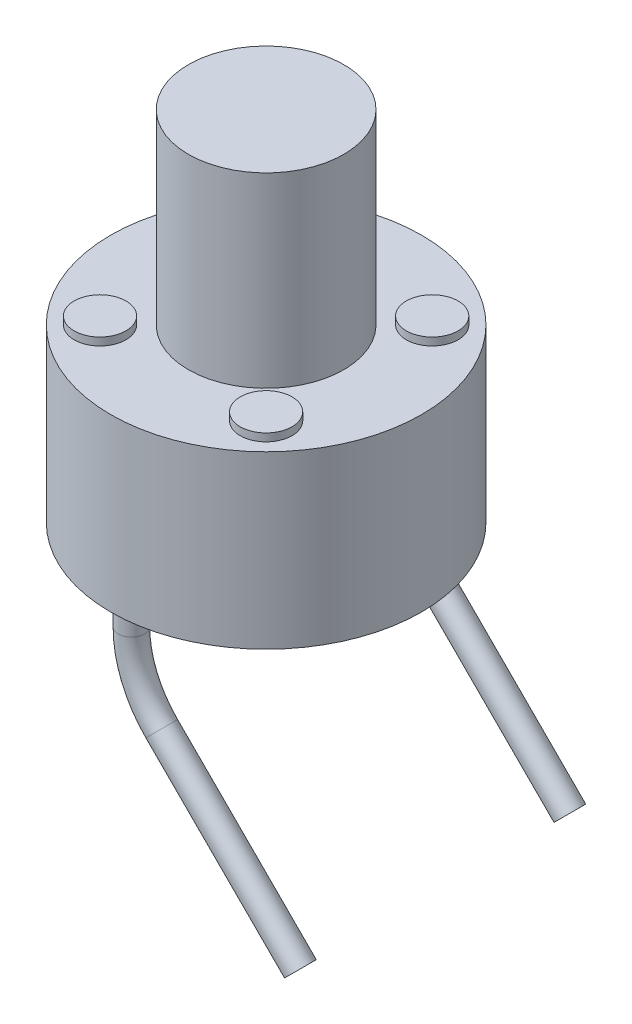
ISO-10303-21;
HEADER;
FILE_DESCRIPTION(('STEP AP214'),'2;1');
FILE_NAME('part.step','',(''),(''),'','','');
FILE_SCHEMA(('AUTOMOTIVE_DESIGN { 1 0 10303 214 1 1 1 1 }'));
ENDSEC;
DATA;
#1=APPLICATION_CONTEXT('core data for automotive mechanical design processes');
#2=APPLICATION_PROTOCOL_DEFINITION('international standard','automotive_design',2000,#1);
#3=PRODUCT_CONTEXT('',#1,'mechanical');
#4=PRODUCT('Part','Part','',(#3));
#5=PRODUCT_RELATED_PRODUCT_CATEGORY('part','',(#4));
#6=PRODUCT_DEFINITION_FORMATION('','',#4);
#7=PRODUCT_DEFINITION_CONTEXT('part definition',#1,'design');
#8=PRODUCT_DEFINITION('design','',#6,#7);
#9=PRODUCT_DEFINITION_SHAPE('','',#8);
#10=(LENGTH_UNIT() NAMED_UNIT(*) SI_UNIT(.MILLI.,.METRE.));
#11=(NAMED_UNIT(*) PLANE_ANGLE_UNIT() SI_UNIT($,.RADIAN.));
#12=(NAMED_UNIT(*) SI_UNIT($,.STERADIAN.) SOLID_ANGLE_UNIT());
#13=UNCERTAINTY_MEASURE_WITH_UNIT(LENGTH_MEASURE(1.E-05),#10,'distance_accuracy_value','');
#14=(GEOMETRIC_REPRESENTATION_CONTEXT(3) GLOBAL_UNCERTAINTY_ASSIGNED_CONTEXT((#13)) GLOBAL_UNIT_ASSIGNED_CONTEXT((#10,
#11,#12)) REPRESENTATION_CONTEXT('',''));
#15=CARTESIAN_POINT('',(0.,0.,0.));
#16=DIRECTION('',(0.,0.,1.));
#17=DIRECTION('',(1.,0.,0.));
#18=AXIS2_PLACEMENT_3D('',#15,#16,#17);
#19=CARTESIAN_POINT('',(0.,3.3,0.));
#20=DIRECTION('',(0.,-1.,0.));
#21=DIRECTION('',(0.,0.,-1.));
#22=AXIS2_PLACEMENT_3D('',#19,#20,#21);
#23=CYLINDRICAL_SURFACE('',#22,3.);
#24=CARTESIAN_POINT('',(0.,3.3,0.));
#25=DIRECTION('',(0.,1.,0.));
#26=DIRECTION('',(0.,0.,1.));
#27=AXIS2_PLACEMENT_3D('',#24,#25,#26);
#28=CIRCLE('',#27,3.);
#29=CARTESIAN_POINT('',(0.,3.3,3.));
#30=VERTEX_POINT('',#29);
#31=EDGE_CURVE('E42',#30,#30,#28,.T.);
#32=ORIENTED_EDGE('',*,*,#31,.F.);
#33=EDGE_LOOP('',(#32));
#34=FACE_BOUND('',#33,.T.);
#35=CARTESIAN_POINT('',(0.,0.,0.));
#36=DIRECTION('',(0.,1.,0.));
#37=DIRECTION('',(0.,0.,1.));
#38=AXIS2_PLACEMENT_3D('',#35,#36,#37);
#39=CIRCLE('',#38,3.);
#40=CARTESIAN_POINT('',(0.,0.,3.));
#41=VERTEX_POINT('',#40);
#42=EDGE_CURVE('E38',#41,#41,#39,.T.);
#43=ORIENTED_EDGE('',*,*,#42,.T.);
#44=EDGE_LOOP('',(#43));
#45=FACE_BOUND('',#44,.T.);
#46=ADVANCED_FACE('F35',(#34,#45),#23,.T.);
#47=CARTESIAN_POINT('',(0.,3.3,0.));
#48=DIRECTION('',(0.,1.,0.));
#49=DIRECTION('',(0.,0.,1.));
#50=AXIS2_PLACEMENT_3D('',#47,#48,#49);
#51=PLANE('',#50);
#52=CARTESIAN_POINT('',(1.60267658968393,3.3,1.60267658968393));
#53=DIRECTION('',(0.,1.,0.));
#54=DIRECTION('',(0.,0.,1.));
#55=AXIS2_PLACEMENT_3D('',#52,#53,#54);
#56=CIRCLE('',#55,0.5);
#57=CARTESIAN_POINT('',(1.60267658968393,3.3,2.10267658968393));
#58=VERTEX_POINT('',#57);
#59=EDGE_CURVE('E70',#58,#58,#56,.T.);
#60=ORIENTED_EDGE('',*,*,#59,.F.);
#61=EDGE_LOOP('',(#60));
#62=FACE_BOUND('',#61,.T.);
#63=CARTESIAN_POINT('',(-1.60267658968393,3.3,1.60267658968393));
#64=DIRECTION('',(0.,1.,0.));
#65=DIRECTION('',(0.,0.,1.));
#66=AXIS2_PLACEMENT_3D('',#63,#64,#65);
#67=CIRCLE('',#66,0.5);
#68=CARTESIAN_POINT('',(-1.60267658968393,3.3,2.10267658968393));
#69=VERTEX_POINT('',#68);
#70=EDGE_CURVE('E64',#69,#69,#67,.T.);
#71=ORIENTED_EDGE('',*,*,#70,.F.);
#72=EDGE_LOOP('',(#71));
#73=FACE_BOUND('',#72,.T.);
#74=CARTESIAN_POINT('',(1.60267658968393,3.3,-1.60267658968393));
#75=DIRECTION('',(0.,1.,0.));
#76=DIRECTION('',(0.,0.,1.));
#77=AXIS2_PLACEMENT_3D('',#74,#75,#76);
#78=CIRCLE('',#77,0.5);
#79=CARTESIAN_POINT('',(1.60267658968393,3.3,-1.10267658968393));
#80=VERTEX_POINT('',#79);
#81=EDGE_CURVE('E58',#80,#80,#78,.T.);
#82=ORIENTED_EDGE('',*,*,#81,.F.);
#83=EDGE_LOOP('',(#82));
#84=FACE_BOUND('',#83,.T.);
#85=CARTESIAN_POINT('',(-1.60267658968393,3.3,-1.60267658968393));
#86=DIRECTION('',(0.,1.,0.));
#87=DIRECTION('',(0.,0.,1.));
#88=AXIS2_PLACEMENT_3D('',#85,#86,#87);
#89=CIRCLE('',#88,0.5);
#90=CARTESIAN_POINT('',(-1.60267658968393,3.3,-1.10267658968393));
#91=VERTEX_POINT('',#90);
#92=EDGE_CURVE('E52',#91,#91,#89,.T.);
#93=ORIENTED_EDGE('',*,*,#92,.F.);
#94=EDGE_LOOP('',(#93));
#95=FACE_BOUND('',#94,.T.);
#96=CARTESIAN_POINT('',(0.,3.3,0.));
#97=DIRECTION('',(0.,1.,0.));
#98=DIRECTION('',(0.,0.,1.));
#99=AXIS2_PLACEMENT_3D('',#96,#97,#98);
#100=CIRCLE('',#99,1.5);
#101=CARTESIAN_POINT('',(0.,3.3,1.5));
#102=VERTEX_POINT('',#101);
#103=EDGE_CURVE('E10',#102,#102,#100,.T.);
#104=ORIENTED_EDGE('',*,*,#103,.F.);
#105=EDGE_LOOP('',(#104));
#106=FACE_BOUND('',#105,.T.);
#107=ORIENTED_EDGE('',*,*,#31,.T.);
#108=EDGE_LOOP('',(#107));
#109=FACE_BOUND('',#108,.T.);
#110=ADVANCED_FACE('F106',(#62,#73,#84,#95,#106,#109),#51,.T.);
#111=CARTESIAN_POINT('',(0.,0.,0.));
#112=DIRECTION('',(0.,1.,0.));
#113=DIRECTION('',(0.,0.,1.));
#114=AXIS2_PLACEMENT_3D('',#111,#112,#113);
#115=PLANE('',#114);
#116=CARTESIAN_POINT('',(0.,0.,-2.6));
#117=DIRECTION('',(0.,-1.,0.));
#118=DIRECTION('',(0.,0.,-1.));
#119=AXIS2_PLACEMENT_3D('',#116,#117,#118);
#120=CIRCLE('',#119,0.25);
#121=CARTESIAN_POINT('',(0.,0.,-2.85));
#122=VERTEX_POINT('',#121);
#123=EDGE_CURVE('E96',#122,#122,#120,.T.);
#124=ORIENTED_EDGE('',*,*,#123,.F.);
#125=EDGE_LOOP('',(#124));
#126=FACE_BOUND('',#125,.T.);
#127=CARTESIAN_POINT('',(0.,0.,2.6));
#128=DIRECTION('',(0.,-1.,0.));
#129=DIRECTION('',(0.,0.,-1.));
#130=AXIS2_PLACEMENT_3D('',#127,#128,#129);
#131=CIRCLE('',#130,0.25);
#132=CARTESIAN_POINT('',(0.,0.,2.35));
#133=VERTEX_POINT('',#132);
#134=EDGE_CURVE('E84',#133,#133,#131,.T.);
#135=ORIENTED_EDGE('',*,*,#134,.F.);
#136=EDGE_LOOP('',(#135));
#137=FACE_BOUND('',#136,.T.);
#138=ORIENTED_EDGE('',*,*,#42,.F.);
#139=EDGE_LOOP('',(#138));
#140=FACE_BOUND('',#139,.T.);
#141=ADVANCED_FACE('F102',(#126,#137,#140),#115,.F.);
#142=CARTESIAN_POINT('',(0.,6.9,0.));
#143=DIRECTION('',(0.,-1.,0.));
#144=DIRECTION('',(0.,0.,-1.));
#145=AXIS2_PLACEMENT_3D('',#142,#143,#144);
#146=CYLINDRICAL_SURFACE('',#145,1.5);
#147=CARTESIAN_POINT('',(0.,6.9,0.));
#148=DIRECTION('',(0.,1.,0.));
#149=DIRECTION('',(0.,0.,1.));
#150=AXIS2_PLACEMENT_3D('',#147,#148,#149);
#151=CIRCLE('',#150,1.5);
#152=CARTESIAN_POINT('',(0.,6.9,1.5));
#153=VERTEX_POINT('',#152);
#154=EDGE_CURVE('E48',#153,#153,#151,.T.);
#155=ORIENTED_EDGE('',*,*,#154,.F.);
#156=EDGE_LOOP('',(#155));
#157=FACE_BOUND('',#156,.T.);
#158=ORIENTED_EDGE('',*,*,#103,.T.);
#159=EDGE_LOOP('',(#158));
#160=FACE_BOUND('',#159,.T.);
#161=ADVANCED_FACE('F105',(#157,#160),#146,.T.);
#162=CARTESIAN_POINT('',(0.,6.9,0.));
#163=DIRECTION('',(0.,1.,0.));
#164=DIRECTION('',(0.,0.,1.));
#165=AXIS2_PLACEMENT_3D('',#162,#163,#164);
#166=PLANE('',#165);
#167=ORIENTED_EDGE('',*,*,#154,.T.);
#168=EDGE_LOOP('',(#167));
#169=FACE_BOUND('',#168,.T.);
#170=ADVANCED_FACE('F128',(#169),#166,.T.);
#171=CARTESIAN_POINT('',(-1.60267658968393,3.45,-1.60267658968393));
#172=DIRECTION('',(0.,-1.,0.));
#173=DIRECTION('',(0.,0.,-1.));
#174=AXIS2_PLACEMENT_3D('',#171,#172,#173);
#175=CYLINDRICAL_SURFACE('',#174,0.5);
#176=CARTESIAN_POINT('',(-1.60267658968393,3.45,-1.60267658968393));
#177=DIRECTION('',(0.,1.,0.));
#178=DIRECTION('',(0.,0.,1.));
#179=AXIS2_PLACEMENT_3D('',#176,#177,#178);
#180=CIRCLE('',#179,0.5);
#181=CARTESIAN_POINT('',(-1.60267658968393,3.45,-1.10267658968393));
#182=VERTEX_POINT('',#181);
#183=EDGE_CURVE('E51',#182,#182,#180,.T.);
#184=ORIENTED_EDGE('',*,*,#183,.F.);
#185=EDGE_LOOP('',(#184));
#186=FACE_BOUND('',#185,.T.);
#187=ORIENTED_EDGE('',*,*,#92,.T.);
#188=EDGE_LOOP('',(#187));
#189=FACE_BOUND('',#188,.T.);
#190=ADVANCED_FACE('F132',(#186,#189),#175,.T.);
#191=CARTESIAN_POINT('',(-1.60267658968393,3.45,-1.60267658968393));
#192=DIRECTION('',(0.,1.,0.));
#193=DIRECTION('',(0.,0.,1.));
#194=AXIS2_PLACEMENT_3D('',#191,#192,#193);
#195=PLANE('',#194);
#196=ORIENTED_EDGE('',*,*,#183,.T.);
#197=EDGE_LOOP('',(#196));
#198=FACE_BOUND('',#197,.T.);
#199=ADVANCED_FACE('F136',(#198),#195,.T.);
#200=CARTESIAN_POINT('',(1.60267658968393,3.45,-1.60267658968393));
#201=DIRECTION('',(0.,-1.,0.));
#202=DIRECTION('',(0.,0.,-1.));
#203=AXIS2_PLACEMENT_3D('',#200,#201,#202);
#204=CYLINDRICAL_SURFACE('',#203,0.5);
#205=CARTESIAN_POINT('',(1.60267658968393,3.45,-1.60267658968393));
#206=DIRECTION('',(0.,1.,0.));
#207=DIRECTION('',(0.,0.,1.));
#208=AXIS2_PLACEMENT_3D('',#205,#206,#207);
#209=CIRCLE('',#208,0.5);
#210=CARTESIAN_POINT('',(1.60267658968393,3.45,-1.10267658968393));
#211=VERTEX_POINT('',#210);
#212=EDGE_CURVE('E55',#211,#211,#209,.T.);
#213=ORIENTED_EDGE('',*,*,#212,.F.);
#214=EDGE_LOOP('',(#213));
#215=FACE_BOUND('',#214,.T.);
#216=ORIENTED_EDGE('',*,*,#81,.T.);
#217=EDGE_LOOP('',(#216));
#218=FACE_BOUND('',#217,.T.);
#219=ADVANCED_FACE('F140',(#215,#218),#204,.T.);
#220=CARTESIAN_POINT('',(1.60267658968393,3.45,-1.60267658968393));
#221=DIRECTION('',(0.,1.,0.));
#222=DIRECTION('',(0.,0.,1.));
#223=AXIS2_PLACEMENT_3D('',#220,#221,#222);
#224=PLANE('',#223);
#225=ORIENTED_EDGE('',*,*,#212,.T.);
#226=EDGE_LOOP('',(#225));
#227=FACE_BOUND('',#226,.T.);
#228=ADVANCED_FACE('F144',(#227),#224,.T.);
#229=CARTESIAN_POINT('',(-1.60267658968393,3.45,1.60267658968393));
#230=DIRECTION('',(0.,-1.,0.));
#231=DIRECTION('',(0.,0.,-1.));
#232=AXIS2_PLACEMENT_3D('',#229,#230,#231);
#233=CYLINDRICAL_SURFACE('',#232,0.5);
#234=CARTESIAN_POINT('',(-1.60267658968393,3.45,1.60267658968393));
#235=DIRECTION('',(0.,1.,0.));
#236=DIRECTION('',(0.,0.,1.));
#237=AXIS2_PLACEMENT_3D('',#234,#235,#236);
#238=CIRCLE('',#237,0.5);
#239=CARTESIAN_POINT('',(-1.60267658968393,3.45,2.10267658968393));
#240=VERTEX_POINT('',#239);
#241=EDGE_CURVE('E61',#240,#240,#238,.T.);
#242=ORIENTED_EDGE('',*,*,#241,.F.);
#243=EDGE_LOOP('',(#242));
#244=FACE_BOUND('',#243,.T.);
#245=ORIENTED_EDGE('',*,*,#70,.T.);
#246=EDGE_LOOP('',(#245));
#247=FACE_BOUND('',#246,.T.);
#248=ADVANCED_FACE('F148',(#244,#247),#233,.T.);
#249=CARTESIAN_POINT('',(-1.60267658968393,3.45,1.60267658968393));
#250=DIRECTION('',(0.,1.,0.));
#251=DIRECTION('',(0.,0.,1.));
#252=AXIS2_PLACEMENT_3D('',#249,#250,#251);
#253=PLANE('',#252);
#254=ORIENTED_EDGE('',*,*,#241,.T.);
#255=EDGE_LOOP('',(#254));
#256=FACE_BOUND('',#255,.T.);
#257=ADVANCED_FACE('F152',(#256),#253,.T.);
#258=CARTESIAN_POINT('',(1.60267658968393,3.45,1.60267658968393));
#259=DIRECTION('',(0.,-1.,0.));
#260=DIRECTION('',(0.,0.,-1.));
#261=AXIS2_PLACEMENT_3D('',#258,#259,#260);
#262=CYLINDRICAL_SURFACE('',#261,0.5);
#263=CARTESIAN_POINT('',(1.60267658968393,3.45,1.60267658968393));
#264=DIRECTION('',(0.,1.,0.));
#265=DIRECTION('',(0.,0.,1.));
#266=AXIS2_PLACEMENT_3D('',#263,#264,#265);
#267=CIRCLE('',#266,0.5);
#268=CARTESIAN_POINT('',(1.60267658968393,3.45,2.10267658968393));
#269=VERTEX_POINT('',#268);
#270=EDGE_CURVE('E67',#269,#269,#267,.T.);
#271=ORIENTED_EDGE('',*,*,#270,.F.);
#272=EDGE_LOOP('',(#271));
#273=FACE_BOUND('',#272,.T.);
#274=ORIENTED_EDGE('',*,*,#59,.T.);
#275=EDGE_LOOP('',(#274));
#276=FACE_BOUND('',#275,.T.);
#277=ADVANCED_FACE('F156',(#273,#276),#262,.T.);
#278=CARTESIAN_POINT('',(1.60267658968393,3.45,1.60267658968393));
#279=DIRECTION('',(0.,1.,0.));
#280=DIRECTION('',(0.,0.,1.));
#281=AXIS2_PLACEMENT_3D('',#278,#279,#280);
#282=PLANE('',#281);
#283=ORIENTED_EDGE('',*,*,#270,.T.);
#284=EDGE_LOOP('',(#283));
#285=FACE_BOUND('',#284,.T.);
#286=ADVANCED_FACE('F160',(#285),#282,.T.);
#287=CARTESIAN_POINT('',(3.26152023658101,-4.53201235516874,2.6));
#288=DIRECTION('',(0.707106781186546,-0.707106781186549,0.));
#289=DIRECTION('',(0.,0.,-1.));
#290=AXIS2_PLACEMENT_3D('',#287,#288,#289);
#291=PLANE('',#290);
#292=CARTESIAN_POINT('',(3.26152023658101,-4.53201235516874,2.6));
#293=DIRECTION('',(0.707106781186546,-0.707106781186549,0.));
#294=DIRECTION('',(0.,0.,-1.));
#295=AXIS2_PLACEMENT_3D('',#292,#293,#294);
#296=CIRCLE('',#295,0.25);
#297=CARTESIAN_POINT('',(3.26152023658101,-4.53201235516874,2.35));
#298=VERTEX_POINT('',#297);
#299=EDGE_CURVE('E73',#298,#298,#296,.T.);
#300=ORIENTED_EDGE('',*,*,#299,.T.);
#301=EDGE_LOOP('',(#300));
#302=FACE_BOUND('',#301,.T.);
#303=ADVANCED_FACE('F164',(#302),#291,.T.);
#304=CARTESIAN_POINT('',(0.,0.,2.6));
#305=DIRECTION('',(0.,-1.,0.));
#306=DIRECTION('',(0.,0.,-1.));
#307=AXIS2_PLACEMENT_3D('',#304,#305,#306);
#308=CYLINDRICAL_SURFACE('',#307,0.25);
#309=CARTESIAN_POINT('',(0.,-0.442064993841524,2.6));
#310=DIRECTION('',(0.,-1.,0.));
#311=DIRECTION('',(0.,0.,-1.));
#312=AXIS2_PLACEMENT_3D('',#309,#310,#311);
#313=CIRCLE('',#312,0.25);
#314=CARTESIAN_POINT('',(-0.25,-0.442064993841523,2.6));
#315=VERTEX_POINT('',#314);
#316=EDGE_CURVE('E81',#315,#315,#313,.T.);
#317=ORIENTED_EDGE('',*,*,#316,.F.);
#318=EDGE_LOOP('',(#317));
#319=FACE_BOUND('',#318,.T.);
#320=ORIENTED_EDGE('',*,*,#134,.T.);
#321=EDGE_LOOP('',(#320));
#322=FACE_BOUND('',#321,.T.);
#323=ADVANCED_FACE('F169',(#319,#322),#308,.T.);
#324=CARTESIAN_POINT('',(2.,-0.442064993841532,2.6));
#325=DIRECTION('',(0.,0.,1.));
#326=DIRECTION('',(1.,0.,0.));
#327=AXIS2_PLACEMENT_3D('',#324,#325,#326);
#328=TOROIDAL_SURFACE('',#327,2.,0.25);
#329=CARTESIAN_POINT('',(0.585786437626908,-1.85627855621463,2.6));
#330=DIRECTION('',(0.707106781186549,-0.707106781186546,0.));
#331=DIRECTION('',(0.,0.,-1.));
#332=AXIS2_PLACEMENT_3D('',#329,#330,#331);
#333=CIRCLE('',#332,0.25);
#334=CARTESIAN_POINT('',(0.409009742330271,-2.03305525151127,2.6));
#335=VERTEX_POINT('',#334);
#336=EDGE_CURVE('E78',#335,#335,#333,.T.);
#337=CARTESIAN_POINT('',(2.,-0.442064993841532,2.6));
#338=DIRECTION('',(0.,0.,1.));
#339=DIRECTION('',(1.,0.,0.));
#340=AXIS2_PLACEMENT_3D('',#337,#338,#339);
#341=CIRCLE('',#340,2.25);
#342=EDGE_CURVE('',#315,#335,#341,.T.);
#343=ORIENTED_EDGE('',*,*,#316,.T.);
#344=ORIENTED_EDGE('',*,*,#336,.F.);
#345=ORIENTED_EDGE('',*,*,#342,.T.);
#346=ORIENTED_EDGE('',*,*,#342,.F.);
#347=EDGE_LOOP('',(#343,#345,#344,#346));
#348=FACE_BOUND('',#347,.T.);
#349=ADVANCED_FACE('F175',(#348),#328,.T.);
#350=CARTESIAN_POINT('',(0.585786437626908,-1.85627855621463,2.6));
#351=DIRECTION('',(0.707106781186546,-0.707106781186549,0.));
#352=DIRECTION('',(0.707106781186549,0.707106781186546,0.));
#353=AXIS2_PLACEMENT_3D('',#350,#351,#352);
#354=CYLINDRICAL_SURFACE('',#353,0.25);
#355=ORIENTED_EDGE('',*,*,#299,.F.);
#356=EDGE_LOOP('',(#355));
#357=FACE_BOUND('',#356,.T.);
#358=ORIENTED_EDGE('',*,*,#336,.T.);
#359=EDGE_LOOP('',(#358));
#360=FACE_BOUND('',#359,.T.);
#361=ADVANCED_FACE('F166',(#357,#360),#354,.T.);
#362=CARTESIAN_POINT('',(3.26152023658101,-4.53201235516874,-2.6));
#363=DIRECTION('',(0.707106781186546,-0.707106781186549,0.));
#364=DIRECTION('',(0.,0.,-1.));
#365=AXIS2_PLACEMENT_3D('',#362,#363,#364);
#366=PLANE('',#365);
#367=CARTESIAN_POINT('',(3.26152023658101,-4.53201235516874,-2.6));
#368=DIRECTION('',(0.707106781186546,-0.707106781186549,0.));
#369=DIRECTION('',(0.,0.,-1.));
#370=AXIS2_PLACEMENT_3D('',#367,#368,#369);
#371=CIRCLE('',#370,0.25);
#372=CARTESIAN_POINT('',(3.26152023658101,-4.53201235516874,-2.85));
#373=VERTEX_POINT('',#372);
#374=EDGE_CURVE('E87',#373,#373,#371,.T.);
#375=ORIENTED_EDGE('',*,*,#374,.T.);
#376=EDGE_LOOP('',(#375));
#377=FACE_BOUND('',#376,.T.);
#378=ADVANCED_FACE('F174',(#377),#366,.T.);
#379=CARTESIAN_POINT('',(0.,0.,-2.6));
#380=DIRECTION('',(0.,-1.,0.));
#381=DIRECTION('',(0.,0.,-1.));
#382=AXIS2_PLACEMENT_3D('',#379,#380,#381);
#383=CYLINDRICAL_SURFACE('',#382,0.25);
#384=CARTESIAN_POINT('',(0.,-0.442064993841524,-2.6));
#385=DIRECTION('',(0.,-1.,0.));
#386=DIRECTION('',(0.,0.,-1.));
#387=AXIS2_PLACEMENT_3D('',#384,#385,#386);
#388=CIRCLE('',#387,0.25);
#389=CARTESIAN_POINT('',(-0.25,-0.442064993841523,-2.6));
#390=VERTEX_POINT('',#389);
#391=EDGE_CURVE('E93',#390,#390,#388,.T.);
#392=ORIENTED_EDGE('',*,*,#391,.F.);
#393=EDGE_LOOP('',(#392));
#394=FACE_BOUND('',#393,.T.);
#395=ORIENTED_EDGE('',*,*,#123,.T.);
#396=EDGE_LOOP('',(#395));
#397=FACE_BOUND('',#396,.T.);
#398=ADVANCED_FACE('F100',(#394,#397),#383,.T.);
#399=CARTESIAN_POINT('',(2.,-0.442064993841532,-2.6));
#400=DIRECTION('',(0.,0.,1.));
#401=DIRECTION('',(1.,0.,0.));
#402=AXIS2_PLACEMENT_3D('',#399,#400,#401);
#403=TOROIDAL_SURFACE('',#402,2.,0.25);
#404=CARTESIAN_POINT('',(0.585786437626908,-1.85627855621463,-2.6));
#405=DIRECTION('',(0.707106781186549,-0.707106781186546,0.));
#406=DIRECTION('',(0.,0.,-1.));
#407=AXIS2_PLACEMENT_3D('',#404,#405,#406);
#408=CIRCLE('',#407,0.25);
#409=CARTESIAN_POINT('',(0.409009742330271,-2.03305525151127,-2.6));
#410=VERTEX_POINT('',#409);
#411=EDGE_CURVE('E90',#410,#410,#408,.T.);
#412=CARTESIAN_POINT('',(2.,-0.442064993841532,-2.6));
#413=DIRECTION('',(0.,0.,1.));
#414=DIRECTION('',(1.,0.,0.));
#415=AXIS2_PLACEMENT_3D('',#412,#413,#414);
#416=CIRCLE('',#415,2.25);
#417=EDGE_CURVE('',#390,#410,#416,.T.);
#418=ORIENTED_EDGE('',*,*,#391,.T.);
#419=ORIENTED_EDGE('',*,*,#411,.F.);
#420=ORIENTED_EDGE('',*,*,#417,.T.);
#421=ORIENTED_EDGE('',*,*,#417,.F.);
#422=EDGE_LOOP('',(#418,#420,#419,#421));
#423=FACE_BOUND('',#422,.T.);
#424=ADVANCED_FACE('F188',(#423),#403,.T.);
#425=CARTESIAN_POINT('',(0.585786437626908,-1.85627855621463,-2.6));
#426=DIRECTION('',(0.707106781186546,-0.707106781186549,0.));
#427=DIRECTION('',(0.707106781186549,0.707106781186546,0.));
#428=AXIS2_PLACEMENT_3D('',#425,#426,#427);
#429=CYLINDRICAL_SURFACE('',#428,0.25);
#430=ORIENTED_EDGE('',*,*,#374,.F.);
#431=EDGE_LOOP('',(#430));
#432=FACE_BOUND('',#431,.T.);
#433=ORIENTED_EDGE('',*,*,#411,.T.);
#434=EDGE_LOOP('',(#433));
#435=FACE_BOUND('',#434,.T.);
#436=ADVANCED_FACE('F171',(#432,#435),#429,.T.);
#437=CLOSED_SHELL('',(#46,#110,#141,#161,#170,#190,#199,#219,#228,#248,#257,#277,#286,#303,#323,
#349,#361,#378,#398,#424,#436));
#438=MANIFOLD_SOLID_BREP('B2',#437);
#439=ADVANCED_BREP_SHAPE_REPRESENTATION('',(#18,#438),#14);
#440=SHAPE_DEFINITION_REPRESENTATION(#9,#439);
ENDSEC;
END-ISO-10303-21;
